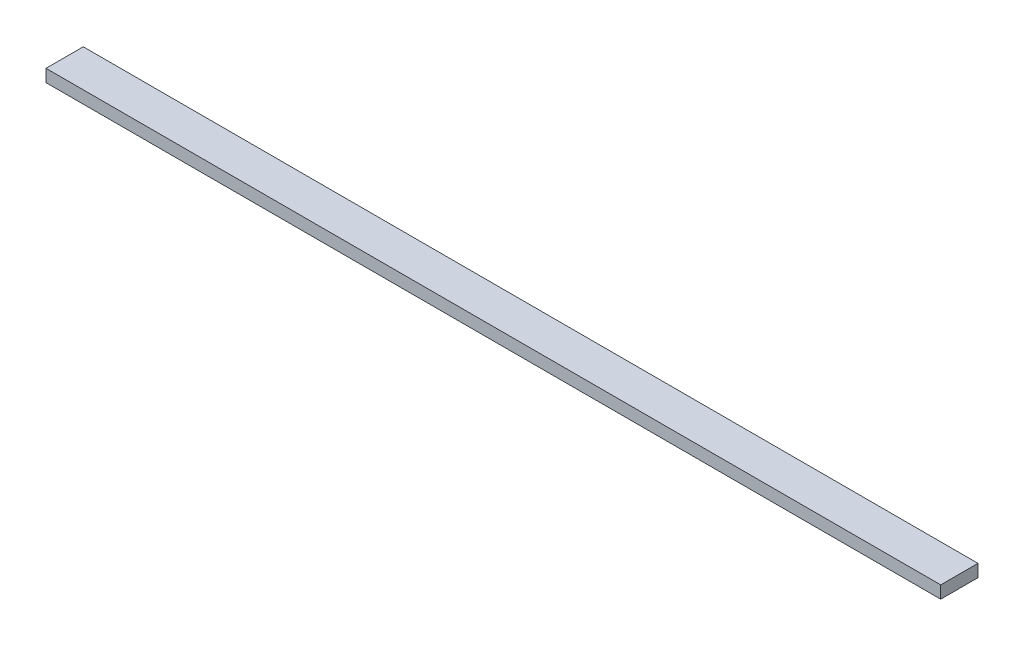
ISO-10303-21;
HEADER;
FILE_DESCRIPTION(('STEP AP214'),'2;1');
FILE_NAME('part.step','',(''),(''),'','','');
FILE_SCHEMA(('AUTOMOTIVE_DESIGN { 1 0 10303 214 1 1 1 1 }'));
ENDSEC;
DATA;
#1=APPLICATION_CONTEXT('core data for automotive mechanical design processes');
#2=APPLICATION_PROTOCOL_DEFINITION('international standard','automotive_design',2000,#1);
#3=PRODUCT_CONTEXT('',#1,'mechanical');
#4=PRODUCT('Part','Part','',(#3));
#5=PRODUCT_RELATED_PRODUCT_CATEGORY('part','',(#4));
#6=PRODUCT_DEFINITION_FORMATION('','',#4);
#7=PRODUCT_DEFINITION_CONTEXT('part definition',#1,'design');
#8=PRODUCT_DEFINITION('design','',#6,#7);
#9=PRODUCT_DEFINITION_SHAPE('','',#8);
#10=(LENGTH_UNIT() NAMED_UNIT(*) SI_UNIT(.MILLI.,.METRE.));
#11=(NAMED_UNIT(*) PLANE_ANGLE_UNIT() SI_UNIT($,.RADIAN.));
#12=(NAMED_UNIT(*) SI_UNIT($,.STERADIAN.) SOLID_ANGLE_UNIT());
#13=UNCERTAINTY_MEASURE_WITH_UNIT(LENGTH_MEASURE(1.E-05),#10,'distance_accuracy_value','');
#14=(GEOMETRIC_REPRESENTATION_CONTEXT(3) GLOBAL_UNCERTAINTY_ASSIGNED_CONTEXT((#13)) GLOBAL_UNIT_ASSIGNED_CONTEXT((#10,
#11,#12)) REPRESENTATION_CONTEXT('',''));
#15=CARTESIAN_POINT('',(0.,0.,0.));
#16=DIRECTION('',(0.,0.,1.));
#17=DIRECTION('',(1.,0.,0.));
#18=AXIS2_PLACEMENT_3D('',#15,#16,#17);
#19=CARTESIAN_POINT('',(0.,12.7,0.));
#20=DIRECTION('',(1.,0.,0.));
#21=DIRECTION('',(0.,0.,-1.));
#22=AXIS2_PLACEMENT_3D('',#19,#20,#21);
#23=PLANE('',#22);
#24=DIRECTION('',(0.,0.,1.));
#25=VECTOR('',#24,1.);
#26=CARTESIAN_POINT('',(0.,0.,0.));
#27=LINE('',#26,#25);
#28=CARTESIAN_POINT('',(0.,0.,-38.1));
#29=VERTEX_POINT('',#28);
#30=CARTESIAN_POINT('',(0.,0.,0.));
#31=VERTEX_POINT('',#30);
#32=EDGE_CURVE('E80',#29,#31,#27,.T.);
#33=ORIENTED_EDGE('',*,*,#32,.T.);
#34=DIRECTION('',(0.,-1.,0.));
#35=VECTOR('',#34,1.);
#36=CARTESIAN_POINT('',(0.,12.7,0.));
#37=LINE('',#36,#35);
#38=CARTESIAN_POINT('',(0.,12.7,0.));
#39=VERTEX_POINT('',#38);
#40=EDGE_CURVE('E11',#39,#31,#37,.T.);
#41=ORIENTED_EDGE('',*,*,#40,.F.);
#42=DIRECTION('',(0.,0.,1.));
#43=VECTOR('',#42,1.);
#44=CARTESIAN_POINT('',(0.,12.7,0.));
#45=LINE('',#44,#43);
#46=CARTESIAN_POINT('',(0.,12.7,-38.1));
#47=VERTEX_POINT('',#46);
#48=EDGE_CURVE('E68',#47,#39,#45,.T.);
#49=ORIENTED_EDGE('',*,*,#48,.F.);
#50=DIRECTION('',(0.,-1.,0.));
#51=VECTOR('',#50,1.);
#52=CARTESIAN_POINT('',(0.,12.7,-38.1));
#53=LINE('',#52,#51);
#54=EDGE_CURVE('E76',#47,#29,#53,.T.);
#55=ORIENTED_EDGE('',*,*,#54,.T.);
#56=EDGE_LOOP('',(#33,#41,#49,#55));
#57=FACE_BOUND('',#56,.T.);
#58=ADVANCED_FACE('F17',(#57),#23,.F.);
#59=CARTESIAN_POINT('',(0.,12.7,0.));
#60=DIRECTION('',(0.,0.,-1.));
#61=DIRECTION('',(-1.,0.,0.));
#62=AXIS2_PLACEMENT_3D('',#59,#60,#61);
#63=PLANE('',#62);
#64=DIRECTION('',(1.,0.,0.));
#65=VECTOR('',#64,1.);
#66=CARTESIAN_POINT('',(0.,0.,0.));
#67=LINE('',#66,#65);
#68=CARTESIAN_POINT('',(914.4,0.,0.));
#69=VERTEX_POINT('',#68);
#70=EDGE_CURVE('E72',#31,#69,#67,.T.);
#71=ORIENTED_EDGE('',*,*,#70,.T.);
#72=DIRECTION('',(0.,-1.,0.));
#73=VECTOR('',#72,1.);
#74=CARTESIAN_POINT('',(914.4,12.7,0.));
#75=LINE('',#74,#73);
#76=CARTESIAN_POINT('',(914.4,12.7,0.));
#77=VERTEX_POINT('',#76);
#78=EDGE_CURVE('E25',#77,#69,#75,.T.);
#79=ORIENTED_EDGE('',*,*,#78,.F.);
#80=DIRECTION('',(1.,0.,0.));
#81=VECTOR('',#80,1.);
#82=CARTESIAN_POINT('',(0.,12.7,0.));
#83=LINE('',#82,#81);
#84=EDGE_CURVE('E63',#39,#77,#83,.T.);
#85=ORIENTED_EDGE('',*,*,#84,.F.);
#86=ORIENTED_EDGE('',*,*,#40,.T.);
#87=EDGE_LOOP('',(#71,#79,#85,#86));
#88=FACE_BOUND('',#87,.T.);
#89=ADVANCED_FACE('F71',(#88),#63,.F.);
#90=CARTESIAN_POINT('',(914.4,12.7,0.));
#91=DIRECTION('',(-1.,0.,0.));
#92=DIRECTION('',(0.,0.,1.));
#93=AXIS2_PLACEMENT_3D('',#90,#91,#92);
#94=PLANE('',#93);
#95=DIRECTION('',(0.,0.,-1.));
#96=VECTOR('',#95,1.);
#97=CARTESIAN_POINT('',(914.4,0.,0.));
#98=LINE('',#97,#96);
#99=CARTESIAN_POINT('',(914.4,0.,-38.1));
#100=VERTEX_POINT('',#99);
#101=EDGE_CURVE('E50',#69,#100,#98,.T.);
#102=ORIENTED_EDGE('',*,*,#101,.T.);
#103=DIRECTION('',(0.,-1.,0.));
#104=VECTOR('',#103,1.);
#105=CARTESIAN_POINT('',(914.4,12.7,-38.1));
#106=LINE('',#105,#104);
#107=CARTESIAN_POINT('',(914.4,12.7,-38.1));
#108=VERTEX_POINT('',#107);
#109=EDGE_CURVE('E73',#108,#100,#106,.T.);
#110=ORIENTED_EDGE('',*,*,#109,.F.);
#111=DIRECTION('',(0.,0.,-1.));
#112=VECTOR('',#111,1.);
#113=CARTESIAN_POINT('',(914.4,12.7,0.));
#114=LINE('',#113,#112);
#115=EDGE_CURVE('E66',#77,#108,#114,.T.);
#116=ORIENTED_EDGE('',*,*,#115,.F.);
#117=ORIENTED_EDGE('',*,*,#78,.T.);
#118=EDGE_LOOP('',(#102,#110,#116,#117));
#119=FACE_BOUND('',#118,.T.);
#120=ADVANCED_FACE('F74',(#119),#94,.F.);
#121=CARTESIAN_POINT('',(0.,12.7,-38.1));
#122=DIRECTION('',(0.,0.,1.));
#123=DIRECTION('',(1.,0.,0.));
#124=AXIS2_PLACEMENT_3D('',#121,#122,#123);
#125=PLANE('',#124);
#126=DIRECTION('',(-1.,0.,0.));
#127=VECTOR('',#126,1.);
#128=CARTESIAN_POINT('',(0.,0.,-38.1));
#129=LINE('',#128,#127);
#130=EDGE_CURVE('E56',#100,#29,#129,.T.);
#131=ORIENTED_EDGE('',*,*,#130,.T.);
#132=ORIENTED_EDGE('',*,*,#54,.F.);
#133=DIRECTION('',(-1.,0.,0.));
#134=VECTOR('',#133,1.);
#135=CARTESIAN_POINT('',(0.,12.7,-38.1));
#136=LINE('',#135,#134);
#137=EDGE_CURVE('E33',#108,#47,#136,.T.);
#138=ORIENTED_EDGE('',*,*,#137,.F.);
#139=ORIENTED_EDGE('',*,*,#109,.T.);
#140=EDGE_LOOP('',(#131,#132,#138,#139));
#141=FACE_BOUND('',#140,.T.);
#142=ADVANCED_FACE('F87',(#141),#125,.F.);
#143=CARTESIAN_POINT('',(0.,12.7,-38.1));
#144=DIRECTION('',(0.,-1.,0.));
#145=DIRECTION('',(0.,0.,-1.));
#146=AXIS2_PLACEMENT_3D('',#143,#144,#145);
#147=PLANE('',#146);
#148=ORIENTED_EDGE('',*,*,#48,.T.);
#149=ORIENTED_EDGE('',*,*,#84,.T.);
#150=ORIENTED_EDGE('',*,*,#115,.T.);
#151=ORIENTED_EDGE('',*,*,#137,.T.);
#152=EDGE_LOOP('',(#148,#149,#150,#151));
#153=FACE_BOUND('',#152,.T.);
#154=ADVANCED_FACE('F64',(#153),#147,.F.);
#155=CARTESIAN_POINT('',(0.,0.,-38.1));
#156=DIRECTION('',(0.,-1.,0.));
#157=DIRECTION('',(0.,0.,-1.));
#158=AXIS2_PLACEMENT_3D('',#155,#156,#157);
#159=PLANE('',#158);
#160=ORIENTED_EDGE('',*,*,#32,.F.);
#161=ORIENTED_EDGE('',*,*,#130,.F.);
#162=ORIENTED_EDGE('',*,*,#101,.F.);
#163=ORIENTED_EDGE('',*,*,#70,.F.);
#164=EDGE_LOOP('',(#160,#161,#162,#163));
#165=FACE_BOUND('',#164,.T.);
#166=ADVANCED_FACE('F90',(#165),#159,.T.);
#167=CLOSED_SHELL('',(#58,#89,#120,#142,#154,#166));
#168=MANIFOLD_SOLID_BREP('B1',#167);
#169=ADVANCED_BREP_SHAPE_REPRESENTATION('',(#18,#168),#14);
#170=SHAPE_DEFINITION_REPRESENTATION(#9,#169);
ENDSEC;
END-ISO-10303-21;
